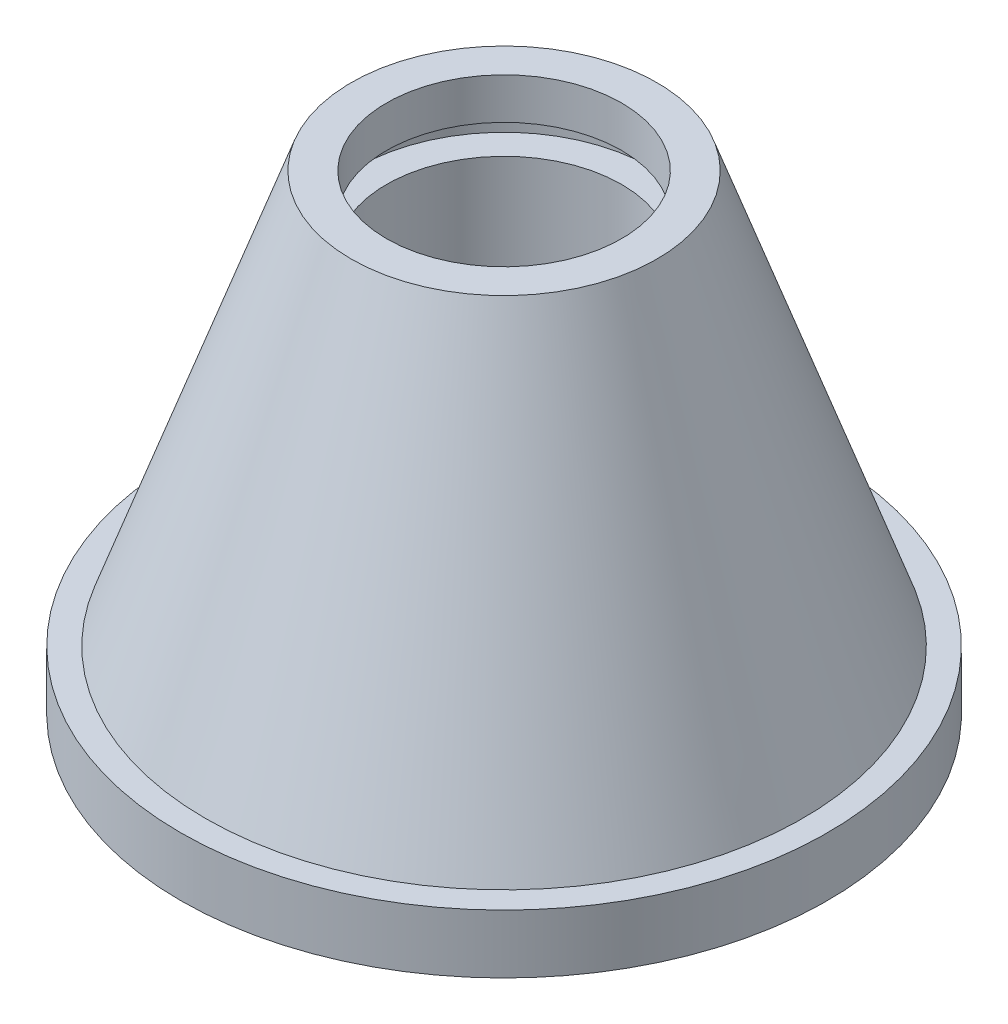
ISO-10303-21;
HEADER;
FILE_DESCRIPTION(('STEP AP214'),'2;1');
FILE_NAME('part.step','',(''),(''),'','','');
FILE_SCHEMA(('AUTOMOTIVE_DESIGN { 1 0 10303 214 1 1 1 1 }'));
ENDSEC;
DATA;
#1=APPLICATION_CONTEXT('core data for automotive mechanical design processes');
#2=APPLICATION_PROTOCOL_DEFINITION('international standard','automotive_design',2000,#1);
#3=PRODUCT_CONTEXT('',#1,'mechanical');
#4=PRODUCT('Part','Part','',(#3));
#5=PRODUCT_RELATED_PRODUCT_CATEGORY('part','',(#4));
#6=PRODUCT_DEFINITION_FORMATION('','',#4);
#7=PRODUCT_DEFINITION_CONTEXT('part definition',#1,'design');
#8=PRODUCT_DEFINITION('design','',#6,#7);
#9=PRODUCT_DEFINITION_SHAPE('','',#8);
#10=(LENGTH_UNIT() NAMED_UNIT(*) SI_UNIT(.MILLI.,.METRE.));
#11=(NAMED_UNIT(*) PLANE_ANGLE_UNIT() SI_UNIT($,.RADIAN.));
#12=(NAMED_UNIT(*) SI_UNIT($,.STERADIAN.) SOLID_ANGLE_UNIT());
#13=UNCERTAINTY_MEASURE_WITH_UNIT(LENGTH_MEASURE(1.E-05),#10,'distance_accuracy_value','');
#14=(GEOMETRIC_REPRESENTATION_CONTEXT(3) GLOBAL_UNCERTAINTY_ASSIGNED_CONTEXT((#13)) GLOBAL_UNIT_ASSIGNED_CONTEXT((#10,
#11,#12)) REPRESENTATION_CONTEXT('',''));
#15=CARTESIAN_POINT('',(0.,0.,0.));
#16=DIRECTION('',(0.,0.,1.));
#17=DIRECTION('',(1.,0.,0.));
#18=AXIS2_PLACEMENT_3D('',#15,#16,#17);
#19=CARTESIAN_POINT('',(0.,128.22914794799,0.));
#20=DIRECTION('',(0.,1.,0.));
#21=DIRECTION('',(0.,0.,1.));
#22=AXIS2_PLACEMENT_3D('',#19,#20,#21);
#23=CYLINDRICAL_SURFACE('',#22,55.);
#24=CARTESIAN_POINT('',(0.,0.,0.));
#25=DIRECTION('',(0.,1.,0.));
#26=DIRECTION('',(0.,0.,1.));
#27=AXIS2_PLACEMENT_3D('',#24,#25,#26);
#28=CIRCLE('',#27,55.);
#29=CARTESIAN_POINT('',(0.,0.,55.));
#30=VERTEX_POINT('',#29);
#31=EDGE_CURVE('E71',#30,#30,#28,.T.);
#32=ORIENTED_EDGE('',*,*,#31,.T.);
#33=EDGE_LOOP('',(#32));
#34=FACE_BOUND('',#33,.T.);
#35=CARTESIAN_POINT('',(0.,10.,0.));
#36=DIRECTION('',(0.,1.,0.));
#37=DIRECTION('',(0.,0.,1.));
#38=AXIS2_PLACEMENT_3D('',#35,#36,#37);
#39=CIRCLE('',#38,55.);
#40=CARTESIAN_POINT('',(0.,10.,55.));
#41=VERTEX_POINT('',#40);
#42=EDGE_CURVE('E10',#41,#41,#39,.T.);
#43=ORIENTED_EDGE('',*,*,#42,.F.);
#44=EDGE_LOOP('',(#43));
#45=FACE_BOUND('',#44,.T.);
#46=ADVANCED_FACE('F31',(#34,#45),#23,.T.);
#47=CARTESIAN_POINT('',(-55.,10.,0.));
#48=DIRECTION('',(0.,1.,0.));
#49=DIRECTION('',(0.,0.,1.));
#50=AXIS2_PLACEMENT_3D('',#47,#48,#49);
#51=PLANE('',#50);
#52=ORIENTED_EDGE('',*,*,#42,.T.);
#53=EDGE_LOOP('',(#52));
#54=FACE_BOUND('',#53,.T.);
#55=CARTESIAN_POINT('',(0.,10.,0.));
#56=DIRECTION('',(0.,1.,0.));
#57=DIRECTION('',(0.,0.,1.));
#58=AXIS2_PLACEMENT_3D('',#55,#56,#57);
#59=CIRCLE('',#58,50.7846715328467);
#60=CARTESIAN_POINT('',(0.,10.,50.7846715328467));
#61=VERTEX_POINT('',#60);
#62=EDGE_CURVE('E37',#61,#61,#59,.T.);
#63=ORIENTED_EDGE('',*,*,#62,.F.);
#64=EDGE_LOOP('',(#63));
#65=FACE_BOUND('',#64,.T.);
#66=ADVANCED_FACE('F89',(#54,#65),#51,.T.);
#67=CARTESIAN_POINT('',(0.,80.,0.));
#68=DIRECTION('',(0.,-1.,0.));
#69=DIRECTION('',(0.,0.,-1.));
#70=AXIS2_PLACEMENT_3D('',#67,#68,#69);
#71=CONICAL_SURFACE('',#70,26.,0.340293143010113);
#72=ORIENTED_EDGE('',*,*,#62,.T.);
#73=EDGE_LOOP('',(#72));
#74=FACE_BOUND('',#73,.T.);
#75=CARTESIAN_POINT('',(0.,80.,0.));
#76=DIRECTION('',(0.,1.,0.));
#77=DIRECTION('',(0.,0.,1.));
#78=AXIS2_PLACEMENT_3D('',#75,#76,#77);
#79=CIRCLE('',#78,26.);
#80=CARTESIAN_POINT('',(0.,80.,26.));
#81=VERTEX_POINT('',#80);
#82=EDGE_CURVE('E41',#81,#81,#79,.T.);
#83=ORIENTED_EDGE('',*,*,#82,.F.);
#84=EDGE_LOOP('',(#83));
#85=FACE_BOUND('',#84,.T.);
#86=ADVANCED_FACE('F93',(#74,#85),#71,.T.);
#87=CARTESIAN_POINT('',(-26.,80.,0.));
#88=DIRECTION('',(0.,1.,0.));
#89=DIRECTION('',(0.,0.,1.));
#90=AXIS2_PLACEMENT_3D('',#87,#88,#89);
#91=PLANE('',#90);
#92=ORIENTED_EDGE('',*,*,#82,.T.);
#93=EDGE_LOOP('',(#92));
#94=FACE_BOUND('',#93,.T.);
#95=CARTESIAN_POINT('',(0.,80.,0.));
#96=DIRECTION('',(0.,1.,0.));
#97=DIRECTION('',(0.,0.,1.));
#98=AXIS2_PLACEMENT_3D('',#95,#96,#97);
#99=CIRCLE('',#98,20.);
#100=CARTESIAN_POINT('',(0.,80.,20.));
#101=VERTEX_POINT('',#100);
#102=EDGE_CURVE('E45',#101,#101,#99,.T.);
#103=ORIENTED_EDGE('',*,*,#102,.F.);
#104=EDGE_LOOP('',(#103));
#105=FACE_BOUND('',#104,.T.);
#106=ADVANCED_FACE('F97',(#94,#105),#91,.T.);
#107=CARTESIAN_POINT('',(0.,128.22914794799,0.));
#108=DIRECTION('',(0.,1.,0.));
#109=DIRECTION('',(0.,0.,1.));
#110=AXIS2_PLACEMENT_3D('',#107,#108,#109);
#111=CYLINDRICAL_SURFACE('',#110,20.);
#112=ORIENTED_EDGE('',*,*,#102,.T.);
#113=EDGE_LOOP('',(#112));
#114=FACE_BOUND('',#113,.T.);
#115=CARTESIAN_POINT('',(0.,73.,0.));
#116=DIRECTION('',(0.,1.,0.));
#117=DIRECTION('',(0.,0.,1.));
#118=AXIS2_PLACEMENT_3D('',#115,#116,#117);
#119=CIRCLE('',#118,20.);
#120=CARTESIAN_POINT('',(0.,73.,20.));
#121=VERTEX_POINT('',#120);
#122=EDGE_CURVE('E50',#121,#121,#119,.T.);
#123=ORIENTED_EDGE('',*,*,#122,.F.);
#124=EDGE_LOOP('',(#123));
#125=FACE_BOUND('',#124,.T.);
#126=ADVANCED_FACE('F103',(#114,#125),#111,.F.);
#127=CARTESIAN_POINT('',(-20.,73.,0.));
#128=DIRECTION('',(0.,-1.,0.));
#129=DIRECTION('',(0.,0.,-1.));
#130=AXIS2_PLACEMENT_3D('',#127,#128,#129);
#131=PLANE('',#130);
#132=ORIENTED_EDGE('',*,*,#122,.T.);
#133=EDGE_LOOP('',(#132));
#134=FACE_BOUND('',#133,.T.);
#135=CARTESIAN_POINT('',(0.,73.,0.));
#136=DIRECTION('',(0.,1.,0.));
#137=DIRECTION('',(0.,0.,1.));
#138=AXIS2_PLACEMENT_3D('',#135,#136,#137);
#139=CIRCLE('',#138,25.);
#140=CARTESIAN_POINT('',(0.,73.,25.));
#141=VERTEX_POINT('',#140);
#142=EDGE_CURVE('E53',#141,#141,#139,.T.);
#143=ORIENTED_EDGE('',*,*,#142,.F.);
#144=EDGE_LOOP('',(#143));
#145=FACE_BOUND('',#144,.T.);
#146=ADVANCED_FACE('F107',(#134,#145),#131,.T.);
#147=CARTESIAN_POINT('',(0.,128.22914794799,0.));
#148=DIRECTION('',(0.,1.,0.));
#149=DIRECTION('',(0.,0.,1.));
#150=AXIS2_PLACEMENT_3D('',#147,#148,#149);
#151=CYLINDRICAL_SURFACE('',#150,25.);
#152=ORIENTED_EDGE('',*,*,#142,.T.);
#153=EDGE_LOOP('',(#152));
#154=FACE_BOUND('',#153,.T.);
#155=CARTESIAN_POINT('',(0.,68.,0.));
#156=DIRECTION('',(0.,1.,0.));
#157=DIRECTION('',(0.,0.,1.));
#158=AXIS2_PLACEMENT_3D('',#155,#156,#157);
#159=CIRCLE('',#158,25.);
#160=CARTESIAN_POINT('',(0.,68.,25.));
#161=VERTEX_POINT('',#160);
#162=EDGE_CURVE('E56',#161,#161,#159,.T.);
#163=ORIENTED_EDGE('',*,*,#162,.F.);
#164=EDGE_LOOP('',(#163));
#165=FACE_BOUND('',#164,.T.);
#166=ADVANCED_FACE('F111',(#154,#165),#151,.F.);
#167=CARTESIAN_POINT('',(-25.,68.,0.));
#168=DIRECTION('',(0.,1.,0.));
#169=DIRECTION('',(0.,0.,1.));
#170=AXIS2_PLACEMENT_3D('',#167,#168,#169);
#171=PLANE('',#170);
#172=ORIENTED_EDGE('',*,*,#162,.T.);
#173=EDGE_LOOP('',(#172));
#174=FACE_BOUND('',#173,.T.);
#175=CARTESIAN_POINT('',(0.,68.,0.));
#176=DIRECTION('',(0.,1.,0.));
#177=DIRECTION('',(0.,0.,1.));
#178=AXIS2_PLACEMENT_3D('',#175,#176,#177);
#179=CIRCLE('',#178,20.);
#180=CARTESIAN_POINT('',(0.,68.,20.));
#181=VERTEX_POINT('',#180);
#182=EDGE_CURVE('E59',#181,#181,#179,.T.);
#183=ORIENTED_EDGE('',*,*,#182,.F.);
#184=EDGE_LOOP('',(#183));
#185=FACE_BOUND('',#184,.T.);
#186=ADVANCED_FACE('F115',(#174,#185),#171,.T.);
#187=CARTESIAN_POINT('',(0.,128.22914794799,0.));
#188=DIRECTION('',(0.,1.,0.));
#189=DIRECTION('',(0.,0.,1.));
#190=AXIS2_PLACEMENT_3D('',#187,#188,#189);
#191=CYLINDRICAL_SURFACE('',#190,20.);
#192=ORIENTED_EDGE('',*,*,#182,.T.);
#193=EDGE_LOOP('',(#192));
#194=FACE_BOUND('',#193,.T.);
#195=CARTESIAN_POINT('',(0.,33.,0.));
#196=DIRECTION('',(0.,1.,0.));
#197=DIRECTION('',(0.,0.,1.));
#198=AXIS2_PLACEMENT_3D('',#195,#196,#197);
#199=CIRCLE('',#198,20.);
#200=CARTESIAN_POINT('',(0.,33.,20.));
#201=VERTEX_POINT('',#200);
#202=EDGE_CURVE('E62',#201,#201,#199,.T.);
#203=ORIENTED_EDGE('',*,*,#202,.F.);
#204=EDGE_LOOP('',(#203));
#205=FACE_BOUND('',#204,.T.);
#206=ADVANCED_FACE('F119',(#194,#205),#191,.F.);
#207=CARTESIAN_POINT('',(-20.,33.,0.));
#208=DIRECTION('',(0.,-1.,0.));
#209=DIRECTION('',(0.,0.,-1.));
#210=AXIS2_PLACEMENT_3D('',#207,#208,#209);
#211=PLANE('',#210);
#212=ORIENTED_EDGE('',*,*,#202,.T.);
#213=EDGE_LOOP('',(#212));
#214=FACE_BOUND('',#213,.T.);
#215=CARTESIAN_POINT('',(0.,33.,0.));
#216=DIRECTION('',(0.,1.,0.));
#217=DIRECTION('',(0.,0.,1.));
#218=AXIS2_PLACEMENT_3D('',#215,#216,#217);
#219=CIRCLE('',#218,35.);
#220=CARTESIAN_POINT('',(0.,33.,35.));
#221=VERTEX_POINT('',#220);
#222=EDGE_CURVE('E65',#221,#221,#219,.T.);
#223=ORIENTED_EDGE('',*,*,#222,.F.);
#224=EDGE_LOOP('',(#223));
#225=FACE_BOUND('',#224,.T.);
#226=ADVANCED_FACE('F85',(#214,#225),#211,.T.);
#227=CARTESIAN_POINT('',(0.,128.22914794799,0.));
#228=DIRECTION('',(0.,1.,0.));
#229=DIRECTION('',(0.,0.,1.));
#230=AXIS2_PLACEMENT_3D('',#227,#228,#229);
#231=CYLINDRICAL_SURFACE('',#230,35.);
#232=ORIENTED_EDGE('',*,*,#222,.T.);
#233=EDGE_LOOP('',(#232));
#234=FACE_BOUND('',#233,.T.);
#235=CARTESIAN_POINT('',(0.,0.,0.));
#236=DIRECTION('',(0.,1.,0.));
#237=DIRECTION('',(0.,0.,1.));
#238=AXIS2_PLACEMENT_3D('',#235,#236,#237);
#239=CIRCLE('',#238,35.);
#240=CARTESIAN_POINT('',(0.,0.,35.));
#241=VERTEX_POINT('',#240);
#242=EDGE_CURVE('E68',#241,#241,#239,.T.);
#243=ORIENTED_EDGE('',*,*,#242,.F.);
#244=EDGE_LOOP('',(#243));
#245=FACE_BOUND('',#244,.T.);
#246=ADVANCED_FACE('F79',(#234,#245),#231,.F.);
#247=CARTESIAN_POINT('',(-55.,0.,0.));
#248=DIRECTION('',(0.,-1.,0.));
#249=DIRECTION('',(0.,0.,-1.));
#250=AXIS2_PLACEMENT_3D('',#247,#248,#249);
#251=PLANE('',#250);
#252=ORIENTED_EDGE('',*,*,#242,.T.);
#253=EDGE_LOOP('',(#252));
#254=FACE_BOUND('',#253,.T.);
#255=ORIENTED_EDGE('',*,*,#31,.F.);
#256=EDGE_LOOP('',(#255));
#257=FACE_BOUND('',#256,.T.);
#258=ADVANCED_FACE('F77',(#254,#257),#251,.T.);
#259=CLOSED_SHELL('',(#46,#66,#86,#106,#126,#146,#166,#186,#206,#226,#246,#258));
#260=MANIFOLD_SOLID_BREP('B2',#259);
#261=ADVANCED_BREP_SHAPE_REPRESENTATION('',(#18,#260),#14);
#262=SHAPE_DEFINITION_REPRESENTATION(#9,#261);
ENDSEC;
END-ISO-10303-21;
